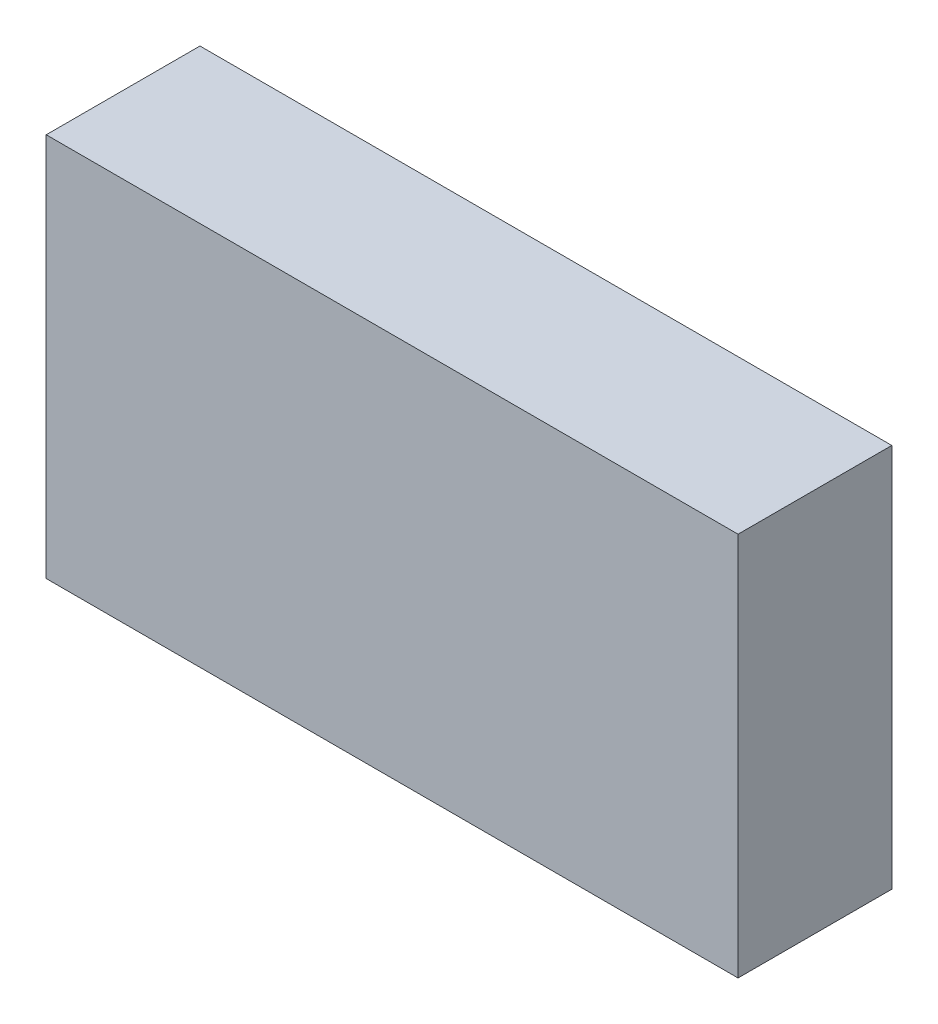
ISO-10303-21;
HEADER;
FILE_DESCRIPTION(('STEP AP214'),'2;1');
FILE_NAME('part.step','',(''),(''),'','','');
FILE_SCHEMA(('AUTOMOTIVE_DESIGN { 1 0 10303 214 1 1 1 1 }'));
ENDSEC;
DATA;
#1=APPLICATION_CONTEXT('core data for automotive mechanical design processes');
#2=APPLICATION_PROTOCOL_DEFINITION('international standard','automotive_design',2000,#1);
#3=PRODUCT_CONTEXT('',#1,'mechanical');
#4=PRODUCT('Part','Part','',(#3));
#5=PRODUCT_RELATED_PRODUCT_CATEGORY('part','',(#4));
#6=PRODUCT_DEFINITION_FORMATION('','',#4);
#7=PRODUCT_DEFINITION_CONTEXT('part definition',#1,'design');
#8=PRODUCT_DEFINITION('design','',#6,#7);
#9=PRODUCT_DEFINITION_SHAPE('','',#8);
#10=(LENGTH_UNIT() NAMED_UNIT(*) SI_UNIT(.MILLI.,.METRE.));
#11=(NAMED_UNIT(*) PLANE_ANGLE_UNIT() SI_UNIT($,.RADIAN.));
#12=(NAMED_UNIT(*) SI_UNIT($,.STERADIAN.) SOLID_ANGLE_UNIT());
#13=UNCERTAINTY_MEASURE_WITH_UNIT(LENGTH_MEASURE(1.E-05),#10,'distance_accuracy_value','');
#14=(GEOMETRIC_REPRESENTATION_CONTEXT(3) GLOBAL_UNCERTAINTY_ASSIGNED_CONTEXT((#13)) GLOBAL_UNIT_ASSIGNED_CONTEXT((#10,
#11,#12)) REPRESENTATION_CONTEXT('',''));
#15=CARTESIAN_POINT('',(0.,0.,0.));
#16=DIRECTION('',(0.,0.,1.));
#17=DIRECTION('',(1.,0.,0.));
#18=AXIS2_PLACEMENT_3D('',#15,#16,#17);
#19=CARTESIAN_POINT('',(0.,0.,-20.));
#20=DIRECTION('',(-1.,0.,0.));
#21=DIRECTION('',(0.,0.,1.));
#22=AXIS2_PLACEMENT_3D('',#19,#20,#21);
#23=PLANE('',#22);
#24=DIRECTION('',(0.,-1.,0.));
#25=VECTOR('',#24,1.);
#26=CARTESIAN_POINT('',(0.,0.,0.));
#27=LINE('',#26,#25);
#28=CARTESIAN_POINT('',(0.,0.,0.));
#29=VERTEX_POINT('',#28);
#30=CARTESIAN_POINT('',(0.,-50.,0.));
#31=VERTEX_POINT('',#30);
#32=EDGE_CURVE('E102',#29,#31,#27,.T.);
#33=ORIENTED_EDGE('',*,*,#32,.F.);
#34=DIRECTION('',(0.,0.,1.));
#35=VECTOR('',#34,1.);
#36=CARTESIAN_POINT('',(0.,0.,-20.));
#37=LINE('',#36,#35);
#38=CARTESIAN_POINT('',(0.,0.,-20.));
#39=VERTEX_POINT('',#38);
#40=EDGE_CURVE('E11',#39,#29,#37,.T.);
#41=ORIENTED_EDGE('',*,*,#40,.F.);
#42=DIRECTION('',(0.,-1.,0.));
#43=VECTOR('',#42,1.);
#44=CARTESIAN_POINT('',(0.,0.,-20.));
#45=LINE('',#44,#43);
#46=CARTESIAN_POINT('',(0.,-50.,-20.));
#47=VERTEX_POINT('',#46);
#48=EDGE_CURVE('E96',#39,#47,#45,.T.);
#49=ORIENTED_EDGE('',*,*,#48,.T.);
#50=DIRECTION('',(0.,0.,1.));
#51=VECTOR('',#50,1.);
#52=CARTESIAN_POINT('',(0.,-50.,-20.));
#53=LINE('',#52,#51);
#54=EDGE_CURVE('E41',#47,#31,#53,.T.);
#55=ORIENTED_EDGE('',*,*,#54,.T.);
#56=EDGE_LOOP('',(#33,#41,#49,#55));
#57=FACE_BOUND('',#56,.T.);
#58=ADVANCED_FACE('F38',(#57),#23,.T.);
#59=CARTESIAN_POINT('',(0.,0.,-20.));
#60=DIRECTION('',(0.,1.,0.));
#61=DIRECTION('',(0.,0.,1.));
#62=AXIS2_PLACEMENT_3D('',#59,#60,#61);
#63=PLANE('',#62);
#64=DIRECTION('',(-1.,0.,0.));
#65=VECTOR('',#64,1.);
#66=CARTESIAN_POINT('',(0.,0.,0.));
#67=LINE('',#66,#65);
#68=CARTESIAN_POINT('',(90.,0.,0.));
#69=VERTEX_POINT('',#68);
#70=EDGE_CURVE('E98',#69,#29,#67,.T.);
#71=ORIENTED_EDGE('',*,*,#70,.F.);
#72=DIRECTION('',(0.,0.,1.));
#73=VECTOR('',#72,1.);
#74=CARTESIAN_POINT('',(90.,0.,-20.));
#75=LINE('',#74,#73);
#76=CARTESIAN_POINT('',(90.,0.,-20.));
#77=VERTEX_POINT('',#76);
#78=EDGE_CURVE('E47',#77,#69,#75,.T.);
#79=ORIENTED_EDGE('',*,*,#78,.F.);
#80=DIRECTION('',(-1.,0.,0.));
#81=VECTOR('',#80,1.);
#82=CARTESIAN_POINT('',(0.,0.,-20.));
#83=LINE('',#82,#81);
#84=EDGE_CURVE('E93',#77,#39,#83,.T.);
#85=ORIENTED_EDGE('',*,*,#84,.T.);
#86=ORIENTED_EDGE('',*,*,#40,.T.);
#87=EDGE_LOOP('',(#71,#79,#85,#86));
#88=FACE_BOUND('',#87,.T.);
#89=ADVANCED_FACE('F112',(#88),#63,.T.);
#90=CARTESIAN_POINT('',(90.,0.,-20.));
#91=DIRECTION('',(1.,0.,0.));
#92=DIRECTION('',(0.,0.,-1.));
#93=AXIS2_PLACEMENT_3D('',#90,#91,#92);
#94=PLANE('',#93);
#95=DIRECTION('',(0.,1.,0.));
#96=VECTOR('',#95,1.);
#97=CARTESIAN_POINT('',(90.,0.,0.));
#98=LINE('',#97,#96);
#99=CARTESIAN_POINT('',(90.,-50.,0.));
#100=VERTEX_POINT('',#99);
#101=EDGE_CURVE('E88',#100,#69,#98,.T.);
#102=ORIENTED_EDGE('',*,*,#101,.F.);
#103=DIRECTION('',(0.,0.,1.));
#104=VECTOR('',#103,1.);
#105=CARTESIAN_POINT('',(90.,-50.,-20.));
#106=LINE('',#105,#104);
#107=CARTESIAN_POINT('',(90.,-50.,-20.));
#108=VERTEX_POINT('',#107);
#109=EDGE_CURVE('E83',#108,#100,#106,.T.);
#110=ORIENTED_EDGE('',*,*,#109,.F.);
#111=DIRECTION('',(0.,1.,0.));
#112=VECTOR('',#111,1.);
#113=CARTESIAN_POINT('',(90.,0.,-20.));
#114=LINE('',#113,#112);
#115=EDGE_CURVE('E86',#108,#77,#114,.T.);
#116=ORIENTED_EDGE('',*,*,#115,.T.);
#117=ORIENTED_EDGE('',*,*,#78,.T.);
#118=EDGE_LOOP('',(#102,#110,#116,#117));
#119=FACE_BOUND('',#118,.T.);
#120=ADVANCED_FACE('F85',(#119),#94,.T.);
#121=CARTESIAN_POINT('',(0.,-50.,-20.));
#122=DIRECTION('',(0.,-1.,0.));
#123=DIRECTION('',(0.,0.,-1.));
#124=AXIS2_PLACEMENT_3D('',#121,#122,#123);
#125=PLANE('',#124);
#126=DIRECTION('',(1.,0.,0.));
#127=VECTOR('',#126,1.);
#128=CARTESIAN_POINT('',(0.,-50.,0.));
#129=LINE('',#128,#127);
#130=EDGE_CURVE('E105',#31,#100,#129,.T.);
#131=ORIENTED_EDGE('',*,*,#130,.F.);
#132=ORIENTED_EDGE('',*,*,#54,.F.);
#133=DIRECTION('',(1.,0.,0.));
#134=VECTOR('',#133,1.);
#135=CARTESIAN_POINT('',(0.,-50.,-20.));
#136=LINE('',#135,#134);
#137=EDGE_CURVE('E92',#47,#108,#136,.T.);
#138=ORIENTED_EDGE('',*,*,#137,.T.);
#139=ORIENTED_EDGE('',*,*,#109,.T.);
#140=EDGE_LOOP('',(#131,#132,#138,#139));
#141=FACE_BOUND('',#140,.T.);
#142=ADVANCED_FACE('F95',(#141),#125,.T.);
#143=CARTESIAN_POINT('',(0.,0.,-20.));
#144=DIRECTION('',(0.,0.,1.));
#145=DIRECTION('',(1.,0.,0.));
#146=AXIS2_PLACEMENT_3D('',#143,#144,#145);
#147=PLANE('',#146);
#148=ORIENTED_EDGE('',*,*,#48,.F.);
#149=ORIENTED_EDGE('',*,*,#84,.F.);
#150=ORIENTED_EDGE('',*,*,#115,.F.);
#151=ORIENTED_EDGE('',*,*,#137,.F.);
#152=EDGE_LOOP('',(#148,#149,#150,#151));
#153=FACE_BOUND('',#152,.T.);
#154=ADVANCED_FACE('F91',(#153),#147,.F.);
#155=CARTESIAN_POINT('',(0.,0.,0.));
#156=DIRECTION('',(0.,0.,1.));
#157=DIRECTION('',(1.,0.,0.));
#158=AXIS2_PLACEMENT_3D('',#155,#156,#157);
#159=PLANE('',#158);
#160=ORIENTED_EDGE('',*,*,#32,.T.);
#161=ORIENTED_EDGE('',*,*,#130,.T.);
#162=ORIENTED_EDGE('',*,*,#101,.T.);
#163=ORIENTED_EDGE('',*,*,#70,.T.);
#164=EDGE_LOOP('',(#160,#161,#162,#163));
#165=FACE_BOUND('',#164,.T.);
#166=ADVANCED_FACE('F111',(#165),#159,.T.);
#167=CLOSED_SHELL('',(#58,#89,#120,#142,#154,#166));
#168=MANIFOLD_SOLID_BREP('B2',#167);
#169=ADVANCED_BREP_SHAPE_REPRESENTATION('',(#18,#168),#14);
#170=SHAPE_DEFINITION_REPRESENTATION(#9,#169);
ENDSEC;
END-ISO-10303-21;
